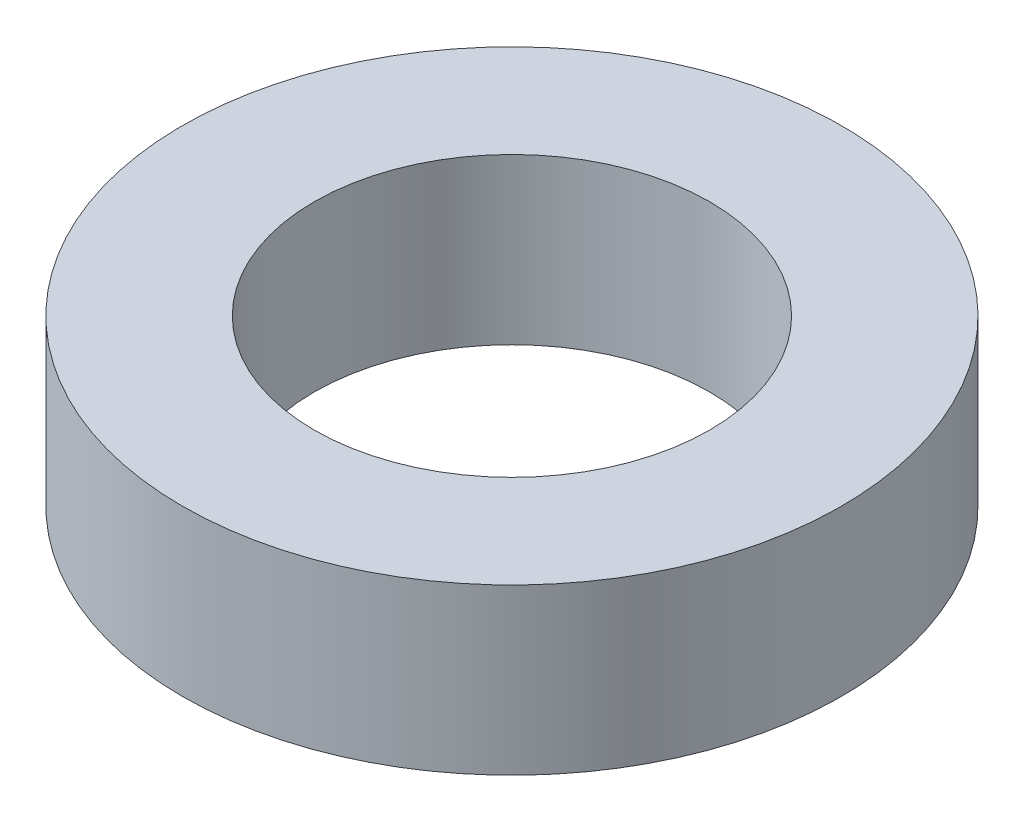
ISO-10303-21;
HEADER;
FILE_DESCRIPTION(('STEP AP214'),'2;1');
FILE_NAME('part.step','',(''),(''),'','','');
FILE_SCHEMA(('AUTOMOTIVE_DESIGN { 1 0 10303 214 1 1 1 1 }'));
ENDSEC;
DATA;
#1=APPLICATION_CONTEXT('core data for automotive mechanical design processes');
#2=APPLICATION_PROTOCOL_DEFINITION('international standard','automotive_design',2000,#1);
#3=PRODUCT_CONTEXT('',#1,'mechanical');
#4=PRODUCT('Part','Part','',(#3));
#5=PRODUCT_RELATED_PRODUCT_CATEGORY('part','',(#4));
#6=PRODUCT_DEFINITION_FORMATION('','',#4);
#7=PRODUCT_DEFINITION_CONTEXT('part definition',#1,'design');
#8=PRODUCT_DEFINITION('design','',#6,#7);
#9=PRODUCT_DEFINITION_SHAPE('','',#8);
#10=(LENGTH_UNIT() NAMED_UNIT(*) SI_UNIT(.MILLI.,.METRE.));
#11=(NAMED_UNIT(*) PLANE_ANGLE_UNIT() SI_UNIT($,.RADIAN.));
#12=(NAMED_UNIT(*) SI_UNIT($,.STERADIAN.) SOLID_ANGLE_UNIT());
#13=UNCERTAINTY_MEASURE_WITH_UNIT(LENGTH_MEASURE(1.E-05),#10,'distance_accuracy_value','');
#14=(GEOMETRIC_REPRESENTATION_CONTEXT(3) GLOBAL_UNCERTAINTY_ASSIGNED_CONTEXT((#13)) GLOBAL_UNIT_ASSIGNED_CONTEXT((#10,
#11,#12)) REPRESENTATION_CONTEXT('',''));
#15=CARTESIAN_POINT('',(0.,0.,0.));
#16=DIRECTION('',(0.,0.,1.));
#17=DIRECTION('',(1.,0.,0.));
#18=AXIS2_PLACEMENT_3D('',#15,#16,#17);
#19=CARTESIAN_POINT('',(0.,25.,0.));
#20=DIRECTION('',(0.,-1.,0.));
#21=DIRECTION('',(0.,0.,-1.));
#22=AXIS2_PLACEMENT_3D('',#19,#20,#21);
#23=CYLINDRICAL_SURFACE('',#22,50.);
#24=CARTESIAN_POINT('',(0.,25.,0.));
#25=DIRECTION('',(0.,1.,0.));
#26=DIRECTION('',(0.,0.,1.));
#27=AXIS2_PLACEMENT_3D('',#24,#25,#26);
#28=CIRCLE('',#27,50.);
#29=CARTESIAN_POINT('',(0.,25.,50.));
#30=VERTEX_POINT('',#29);
#31=EDGE_CURVE('E10',#30,#30,#28,.T.);
#32=ORIENTED_EDGE('',*,*,#31,.F.);
#33=EDGE_LOOP('',(#32));
#34=FACE_BOUND('',#33,.T.);
#35=CARTESIAN_POINT('',(0.,0.,0.));
#36=DIRECTION('',(0.,1.,0.));
#37=DIRECTION('',(0.,0.,1.));
#38=AXIS2_PLACEMENT_3D('',#35,#36,#37);
#39=CIRCLE('',#38,50.);
#40=CARTESIAN_POINT('',(0.,0.,50.));
#41=VERTEX_POINT('',#40);
#42=EDGE_CURVE('E37',#41,#41,#39,.T.);
#43=ORIENTED_EDGE('',*,*,#42,.T.);
#44=EDGE_LOOP('',(#43));
#45=FACE_BOUND('',#44,.T.);
#46=ADVANCED_FACE('F40',(#34,#45),#23,.T.);
#47=CARTESIAN_POINT('',(0.,25.,0.));
#48=DIRECTION('',(0.,1.,0.));
#49=DIRECTION('',(0.,0.,1.));
#50=AXIS2_PLACEMENT_3D('',#47,#48,#49);
#51=PLANE('',#50);
#52=CARTESIAN_POINT('',(0.,25.,0.));
#53=DIRECTION('',(0.,1.,0.));
#54=DIRECTION('',(0.,0.,1.));
#55=AXIS2_PLACEMENT_3D('',#52,#53,#54);
#56=CIRCLE('',#55,30.);
#57=CARTESIAN_POINT('',(0.,25.,30.));
#58=VERTEX_POINT('',#57);
#59=EDGE_CURVE('E50',#58,#58,#56,.T.);
#60=ORIENTED_EDGE('',*,*,#59,.F.);
#61=EDGE_LOOP('',(#60));
#62=FACE_BOUND('',#61,.T.);
#63=ORIENTED_EDGE('',*,*,#31,.T.);
#64=EDGE_LOOP('',(#63));
#65=FACE_BOUND('',#64,.T.);
#66=ADVANCED_FACE('F59',(#62,#65),#51,.T.);
#67=CARTESIAN_POINT('',(0.,0.,0.));
#68=DIRECTION('',(0.,1.,0.));
#69=DIRECTION('',(0.,0.,1.));
#70=AXIS2_PLACEMENT_3D('',#67,#68,#69);
#71=PLANE('',#70);
#72=CARTESIAN_POINT('',(0.,0.,0.));
#73=DIRECTION('',(0.,1.,0.));
#74=DIRECTION('',(0.,0.,1.));
#75=AXIS2_PLACEMENT_3D('',#72,#73,#74);
#76=CIRCLE('',#75,30.);
#77=CARTESIAN_POINT('',(0.,0.,30.));
#78=VERTEX_POINT('',#77);
#79=EDGE_CURVE('E47',#78,#78,#76,.T.);
#80=ORIENTED_EDGE('',*,*,#79,.T.);
#81=EDGE_LOOP('',(#80));
#82=FACE_BOUND('',#81,.T.);
#83=ORIENTED_EDGE('',*,*,#42,.F.);
#84=EDGE_LOOP('',(#83));
#85=FACE_BOUND('',#84,.T.);
#86=ADVANCED_FACE('F58',(#82,#85),#71,.F.);
#87=CARTESIAN_POINT('',(0.,25.,0.));
#88=DIRECTION('',(0.,-1.,0.));
#89=DIRECTION('',(0.,0.,-1.));
#90=AXIS2_PLACEMENT_3D('',#87,#88,#89);
#91=CYLINDRICAL_SURFACE('',#90,30.);
#92=ORIENTED_EDGE('',*,*,#59,.T.);
#93=EDGE_LOOP('',(#92));
#94=FACE_BOUND('',#93,.T.);
#95=ORIENTED_EDGE('',*,*,#79,.F.);
#96=EDGE_LOOP('',(#95));
#97=FACE_BOUND('',#96,.T.);
#98=ADVANCED_FACE('F54',(#94,#97),#91,.F.);
#99=CLOSED_SHELL('',(#46,#66,#86,#98));
#100=MANIFOLD_SOLID_BREP('B2',#99);
#101=ADVANCED_BREP_SHAPE_REPRESENTATION('',(#18,#100),#14);
#102=SHAPE_DEFINITION_REPRESENTATION(#9,#101);
ENDSEC;
END-ISO-10303-21;
